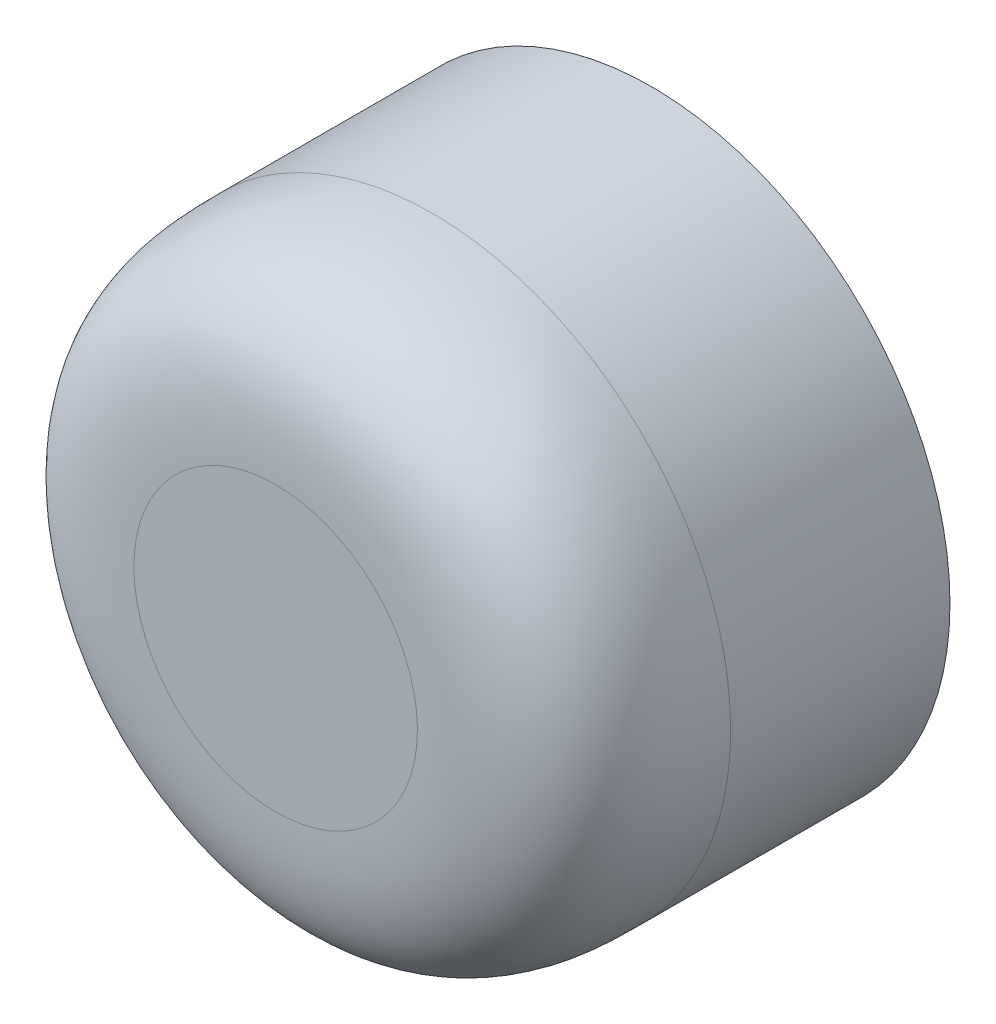
ISO-10303-21;
HEADER;
FILE_DESCRIPTION(('STEP AP214'),'2;1');
FILE_NAME('part.step','',(''),(''),'','','');
FILE_SCHEMA(('AUTOMOTIVE_DESIGN { 1 0 10303 214 1 1 1 1 }'));
ENDSEC;
DATA;
#1=APPLICATION_CONTEXT('core data for automotive mechanical design processes');
#2=APPLICATION_PROTOCOL_DEFINITION('international standard','automotive_design',2000,#1);
#3=PRODUCT_CONTEXT('',#1,'mechanical');
#4=PRODUCT('Part','Part','',(#3));
#5=PRODUCT_RELATED_PRODUCT_CATEGORY('part','',(#4));
#6=PRODUCT_DEFINITION_FORMATION('','',#4);
#7=PRODUCT_DEFINITION_CONTEXT('part definition',#1,'design');
#8=PRODUCT_DEFINITION('design','',#6,#7);
#9=PRODUCT_DEFINITION_SHAPE('','',#8);
#10=(LENGTH_UNIT() NAMED_UNIT(*) SI_UNIT(.MILLI.,.METRE.));
#11=(NAMED_UNIT(*) PLANE_ANGLE_UNIT() SI_UNIT($,.RADIAN.));
#12=(NAMED_UNIT(*) SI_UNIT($,.STERADIAN.) SOLID_ANGLE_UNIT());
#13=UNCERTAINTY_MEASURE_WITH_UNIT(LENGTH_MEASURE(1.E-05),#10,'distance_accuracy_value','');
#14=(GEOMETRIC_REPRESENTATION_CONTEXT(3) GLOBAL_UNCERTAINTY_ASSIGNED_CONTEXT((#13)) GLOBAL_UNIT_ASSIGNED_CONTEXT((#10,
#11,#12)) REPRESENTATION_CONTEXT('',''));
#15=CARTESIAN_POINT('',(0.,0.,0.));
#16=DIRECTION('',(0.,0.,1.));
#17=DIRECTION('',(1.,0.,0.));
#18=AXIS2_PLACEMENT_3D('',#15,#16,#17);
#19=CARTESIAN_POINT('',(0.,0.,12.));
#20=DIRECTION('',(0.,0.,-1.));
#21=DIRECTION('',(-1.,0.,0.));
#22=AXIS2_PLACEMENT_3D('',#19,#20,#21);
#23=CYLINDRICAL_SURFACE('',#22,9.525);
#24=CARTESIAN_POINT('',(9.525,0.,7.));
#25=CARTESIAN_POINT('',(9.525,1.24665180379261,7.));
#26=CARTESIAN_POINT('',(9.02905107681899,3.73995541137782,7.));
#27=CARTESIAN_POINT('',(6.9105365141536,6.9105365141536,7.));
#28=CARTESIAN_POINT('',(3.73995541137781,9.02905107681899,7.));
#29=CARTESIAN_POINT('',(0.,9.77297446159051,7.));
#30=CARTESIAN_POINT('',(-3.73995541137782,9.02905107681899,7.));
#31=CARTESIAN_POINT('',(-6.9105365141536,6.91053651415358,7.));
#32=CARTESIAN_POINT('',(-9.02905107681898,3.73995541137785,7.));
#33=CARTESIAN_POINT('',(-9.7729744615905,0.,7.));
#34=CARTESIAN_POINT('',(-9.029051076819,-3.73995541137779,7.));
#35=CARTESIAN_POINT('',(-6.91053651415358,-6.91053651415361,7.));
#36=CARTESIAN_POINT('',(-3.73995541137785,-9.02905107681897,7.));
#37=CARTESIAN_POINT('',(0.,-9.77297446159051,7.));
#38=CARTESIAN_POINT('',(3.73995541137779,-9.02905107681899,7.));
#39=CARTESIAN_POINT('',(6.91053651415358,-6.91053651415362,7.));
#40=CARTESIAN_POINT('',(9.02905107681898,-3.73995541137783,7.));
#41=CARTESIAN_POINT('',(9.525,-1.24665180379261,7.));
#42=CARTESIAN_POINT('',(9.525,0.,7.));
#43=B_SPLINE_CURVE_WITH_KNOTS('',3,(#24,#25,#26,#27,#28,#29,#30,#31,#32,#33,#34,#35,#36,#37,#38,
#39,#40,#41,#42),.UNSPECIFIED.,.T.,.F.,(4,1,1,1,1,1,1,1,1,1,1,1,1,1,1,1,4),(0.,
0.392699081698724,0.785398163397448,1.17809724509617,1.5707963267949,1.96349540849362,
2.35619449019234,2.74889357189107,3.14159265358979,3.53429173528852,3.92699081698724,
4.31968989868597,4.71238898038469,5.10508806208341,5.49778714378214,5.89048622548086,
6.28318530717959),.UNSPECIFIED.);
#44=CARTESIAN_POINT('',(9.525,0.,7.));
#45=VERTEX_POINT('',#44);
#46=EDGE_CURVE('E10',#45,#45,#43,.F.);
#47=ORIENTED_EDGE('',*,*,#46,.T.);
#48=EDGE_LOOP('',(#47));
#49=FACE_BOUND('',#48,.T.);
#50=CARTESIAN_POINT('',(0.,0.,0.));
#51=DIRECTION('',(0.,0.,1.));
#52=DIRECTION('',(1.,0.,0.));
#53=AXIS2_PLACEMENT_3D('',#50,#51,#52);
#54=CIRCLE('',#53,9.525);
#55=CARTESIAN_POINT('',(9.525,0.,0.));
#56=VERTEX_POINT('',#55);
#57=EDGE_CURVE('E51',#56,#56,#54,.T.);
#58=ORIENTED_EDGE('',*,*,#57,.T.);
#59=EDGE_LOOP('',(#58));
#60=FACE_BOUND('',#59,.T.);
#61=ADVANCED_FACE('F33',(#49,#60),#23,.T.);
#62=CARTESIAN_POINT('',(0.,0.,12.));
#63=DIRECTION('',(0.,0.,1.));
#64=DIRECTION('',(1.,0.,0.));
#65=AXIS2_PLACEMENT_3D('',#62,#63,#64);
#66=PLANE('',#65);
#67=CARTESIAN_POINT('',(4.525,0.,12.));
#68=CARTESIAN_POINT('',(4.52500005359573,-0.0740319228077651,12.));
#69=CARTESIAN_POINT('',(4.5231592298511,-0.148062308991933,12.));
#70=CARTESIAN_POINT('',(4.51583144496194,-0.295946996831009,12.));
#71=CARTESIAN_POINT('',(4.51034426931116,-0.369801287870123,12.));
#72=CARTESIAN_POINT('',(4.49575890582572,-0.517157077712651,12.));
#73=CARTESIAN_POINT('',(4.4866604701935,-0.590658551956111,12.));
#74=CARTESIAN_POINT('',(4.46488758724288,-0.737133065383583,12.));
#75=CARTESIAN_POINT('',(4.45221298569578,-0.810106081637632,12.));
#76=CARTESIAN_POINT('',(4.42332263004839,-0.955347719452519,12.));
#77=CARTESIAN_POINT('',(4.4071068759481,-1.02761634101336,12.));
#78=CARTESIAN_POINT('',(4.37116901219801,-1.17127329588665,12.));
#79=CARTESIAN_POINT('',(4.35144705381296,-1.24266166703286,12.));
#80=CARTESIAN_POINT('',(4.30853160908515,-1.38438212811499,12.));
#81=CARTESIAN_POINT('',(4.28533836106953,-1.45471429020219,12.));
#82=CARTESIAN_POINT('',(4.23551512311112,-1.59414657644436,12.));
#83=CARTESIAN_POINT('',(4.20888533542997,-1.66324677283593,12.));
#84=CARTESIAN_POINT('',(4.15222443379717,-1.80003829006815,12.));
#85=CARTESIAN_POINT('',(4.12219331984551,-1.8677296109088,12.));
#86=CARTESIAN_POINT('',(4.0588301540157,-2.00155347555232,12.));
#87=CARTESIAN_POINT('',(4.02549790803794,-2.06768592741361,12.));
#88=CARTESIAN_POINT('',(3.95563221145121,-2.19824322802937,12.));
#89=CARTESIAN_POINT('',(3.91909854130089,-2.26266795927973,12.));
#90=CARTESIAN_POINT('',(3.84292963966635,-2.38966067502199,12.));
#91=CARTESIAN_POINT('',(3.80329427446915,-2.45222857930618,12.));
#92=CARTESIAN_POINT('',(3.72102150070867,-2.57535848662685,12.));
#93=CARTESIAN_POINT('',(3.6783840921454,-2.63592048966332,12.));
#94=CARTESIAN_POINT('',(3.59020669800922,-2.75488938724318,12.));
#95=CARTESIAN_POINT('',(3.54466683770832,-2.8132963746271,12.));
#96=CARTESIAN_POINT('',(3.45078406442709,-2.9278059776471,12.));
#97=CARTESIAN_POINT('',(3.40244134402124,-2.98390875114606,12.));
#98=CARTESIAN_POINT('',(3.30305224828884,-3.09366085902961,12.));
#99=CARTESIAN_POINT('',(3.25200603218393,-3.14731033755432,12.));
#100=CARTESIAN_POINT('',(3.14731033755431,-3.25200603218395,12.));
#101=CARTESIAN_POINT('',(3.09366085902959,-3.30305224828886,12.));
#102=CARTESIAN_POINT('',(2.98390875114603,-3.40244134402125,12.));
#103=CARTESIAN_POINT('',(2.92780597764707,-3.4507840644271,12.));
#104=CARTESIAN_POINT('',(2.81329637462709,-3.54466683770834,12.));
#105=CARTESIAN_POINT('',(2.7548893872432,-3.59020669800924,12.));
#106=CARTESIAN_POINT('',(2.63592048966327,-3.67838409214541,12.));
#107=CARTESIAN_POINT('',(2.57535848662671,-3.72102150070868,12.));
#108=CARTESIAN_POINT('',(2.45222857930628,-3.80329427446917,12.));
#109=CARTESIAN_POINT('',(2.38966067502242,-3.84292963966639,12.));
#110=CARTESIAN_POINT('',(2.26266795927926,-3.91909854130088,12.));
#111=CARTESIAN_POINT('',(2.19824322802766,-3.95563221145112,12.));
#112=CARTESIAN_POINT('',(2.06768592741528,-4.02549790803805,12.));
#113=CARTESIAN_POINT('',(2.00155347555862,-4.05883015401609,12.));
#114=CARTESIAN_POINT('',(1.86772961090247,-4.12219331984514,12.));
#115=CARTESIAN_POINT('',(1.80003829004456,-4.15222443379575,12.));
#116=CARTESIAN_POINT('',(1.66324677285949,-4.2088853354314,12.));
#117=CARTESIAN_POINT('',(1.59414657653232,-4.23551512311644,12.));
#118=CARTESIAN_POINT('',(1.4547142901142,-4.28533836106422,12.));
#119=CARTESIAN_POINT('',(1.38438212778661,-4.30853160906532,12.));
#120=CARTESIAN_POINT('',(1.24266166736125,-4.3514470538328,12.));
#121=CARTESIAN_POINT('',(1.17127329711225,-4.37116901227205,12.));
#122=CARTESIAN_POINT('',(1.02761633978769,-4.40710687587406,12.));
#123=CARTESIAN_POINT('',(0.955347714878181,-4.42332262977205,12.));
#124=CARTESIAN_POINT('',(0.810106086211968,-4.45221298597213,12.));
#125=CARTESIAN_POINT('',(0.737133082455265,-4.46488758827421,12.));
#126=CARTESIAN_POINT('',(0.590658534885169,-4.48666046916222,12.));
#127=CARTESIAN_POINT('',(0.517157014004287,-4.49575890197699,12.));
#128=CARTESIAN_POINT('',(0.369801351574122,-4.51034427315963,12.));
#129=CARTESIAN_POINT('',(0.295947234569648,-4.51583145932414,12.));
#130=CARTESIAN_POINT('',(0.148062071267291,-4.52315921548975,12.));
#131=CARTESIAN_POINT('',(0.0740310356336492,-4.525,12.));
#132=CARTESIAN_POINT('',(-0.0740310356336353,-4.525,12.));
#133=CARTESIAN_POINT('',(-0.148062071267278,-4.52315921548974,12.));
#134=CARTESIAN_POINT('',(-0.295947234569636,-4.51583145932414,12.));
#135=CARTESIAN_POINT('',(-0.36980135157411,-4.51034427315963,12.));
#136=CARTESIAN_POINT('',(-0.517157014004277,-4.49575890197699,12.));
#137=CARTESIAN_POINT('',(-0.59065853488516,-4.48666046916222,12.));
#138=CARTESIAN_POINT('',(-0.737133082455259,-4.46488758827421,12.));
#139=CARTESIAN_POINT('',(-0.810106086211963,-4.45221298597212,12.));
#140=CARTESIAN_POINT('',(-0.955347714878179,-4.42332262977205,12.));
#141=CARTESIAN_POINT('',(-1.02761633978769,-4.40710687587406,12.));
#142=CARTESIAN_POINT('',(-1.17127329711225,-4.37116901227205,12.));
#143=CARTESIAN_POINT('',(-1.24266166736125,-4.35144705383279,12.));
#144=CARTESIAN_POINT('',(-1.38438212778662,-4.30853160906531,12.));
#145=CARTESIAN_POINT('',(-1.45471429011421,-4.28533836106422,12.));
#146=CARTESIAN_POINT('',(-1.59414657653233,-4.23551512311643,12.));
#147=CARTESIAN_POINT('',(-1.6632467728595,-4.20888533543139,12.));
#148=CARTESIAN_POINT('',(-1.80003829004457,-4.15222443379574,12.));
#149=CARTESIAN_POINT('',(-1.86772961090248,-4.12219331984513,12.));
#150=CARTESIAN_POINT('',(-2.00155347555863,-4.05883015401608,12.));
#151=CARTESIAN_POINT('',(-2.0676859274153,-4.02549790803805,12.));
#152=CARTESIAN_POINT('',(-2.19824322802767,-3.95563221145111,12.));
#153=CARTESIAN_POINT('',(-2.26266795927927,-3.91909854130087,12.));
#154=CARTESIAN_POINT('',(-2.38966067502243,-3.84292963966638,12.));
#155=CARTESIAN_POINT('',(-2.4522285793063,-3.80329427446916,12.));
#156=CARTESIAN_POINT('',(-2.57535848662672,-3.72102150070867,12.));
#157=CARTESIAN_POINT('',(-2.63592048966328,-3.6783840921454,12.));
#158=CARTESIAN_POINT('',(-2.75488938724321,-3.59020669800923,12.));
#159=CARTESIAN_POINT('',(-2.8132963746271,-3.54466683770833,12.));
#160=CARTESIAN_POINT('',(-2.92780597764708,-3.4507840644271,12.));
#161=CARTESIAN_POINT('',(-2.98390875114604,-3.40244134402125,12.));
#162=CARTESIAN_POINT('',(-3.0936608590296,-3.30305224828885,12.));
#163=CARTESIAN_POINT('',(-3.14731033755431,-3.25200603218394,12.));
#164=CARTESIAN_POINT('',(-3.25200603218394,-3.14731033755432,12.));
#165=CARTESIAN_POINT('',(-3.30305224828884,-3.0936608590296,12.));
#166=CARTESIAN_POINT('',(-3.40244134402124,-2.98390875114604,12.));
#167=CARTESIAN_POINT('',(-3.45078406442709,-2.92780597764708,12.));
#168=CARTESIAN_POINT('',(-3.54466683770833,-2.8132963746271,12.));
#169=CARTESIAN_POINT('',(-3.59020669800923,-2.75488938724321,12.));
#170=CARTESIAN_POINT('',(-3.6783840921454,-2.63592048966328,12.));
#171=CARTESIAN_POINT('',(-3.72102150070867,-2.57535848662672,12.));
#172=CARTESIAN_POINT('',(-3.80329427446916,-2.45222857930629,12.));
#173=CARTESIAN_POINT('',(-3.84292963966639,-2.38966067502243,12.));
#174=CARTESIAN_POINT('',(-3.91909854130087,-2.26266795927926,12.));
#175=CARTESIAN_POINT('',(-3.95563221145112,-2.19824322802767,12.));
#176=CARTESIAN_POINT('',(-4.02549790803805,-2.06768592741529,12.));
#177=CARTESIAN_POINT('',(-4.05883015401608,-2.00155347555862,12.));
#178=CARTESIAN_POINT('',(-4.12219331984514,-1.86772961090247,12.));
#179=CARTESIAN_POINT('',(-4.15222443379575,-1.80003829004456,12.));
#180=CARTESIAN_POINT('',(-4.2088853354314,-1.66324677285949,12.));
#181=CARTESIAN_POINT('',(-4.23551512311643,-1.59414657653232,12.));
#182=CARTESIAN_POINT('',(-4.28533836106422,-1.4547142901142,12.));
#183=CARTESIAN_POINT('',(-4.30853160906532,-1.38438212778661,12.));
#184=CARTESIAN_POINT('',(-4.3514470538328,-1.24266166736125,12.));
#185=CARTESIAN_POINT('',(-4.37116901227205,-1.17127329711225,12.));
#186=CARTESIAN_POINT('',(-4.40710687587406,-1.02761633978769,12.));
#187=CARTESIAN_POINT('',(-4.42332262977205,-0.955347714878177,12.));
#188=CARTESIAN_POINT('',(-4.45221298597213,-0.810106086211962,12.));
#189=CARTESIAN_POINT('',(-4.46488758827421,-0.737133082455259,12.));
#190=CARTESIAN_POINT('',(-4.48666046916222,-0.590658534885162,12.));
#191=CARTESIAN_POINT('',(-4.49575890197699,-0.517157014004281,12.));
#192=CARTESIAN_POINT('',(-4.51034427315963,-0.369801351574116,12.));
#193=CARTESIAN_POINT('',(-4.51583145932414,-0.295947234569642,12.));
#194=CARTESIAN_POINT('',(-4.52315921548974,-0.148062071267284,12.));
#195=CARTESIAN_POINT('',(-4.525,-0.0740310356336416,12.));
#196=CARTESIAN_POINT('',(-4.525,0.0740310356336429,12.));
#197=CARTESIAN_POINT('',(-4.52315921548974,0.148062071267285,12.));
#198=CARTESIAN_POINT('',(-4.51583145932414,0.295947234569644,12.));
#199=CARTESIAN_POINT('',(-4.51034427315963,0.369801351574119,12.));
#200=CARTESIAN_POINT('',(-4.49575890197699,0.517157014004285,12.));
#201=CARTESIAN_POINT('',(-4.48666046916221,0.590658534885166,12.));
#202=CARTESIAN_POINT('',(-4.46488758827421,0.737133082455264,12.));
#203=CARTESIAN_POINT('',(-4.45221298597212,0.810106086211968,12.));
#204=CARTESIAN_POINT('',(-4.42332262977205,0.955347714878184,12.));
#205=CARTESIAN_POINT('',(-4.40710687587406,1.0276163397877,12.));
#206=CARTESIAN_POINT('',(-4.37116901227205,1.17127329711226,12.));
#207=CARTESIAN_POINT('',(-4.35144705383279,1.24266166736126,12.));
#208=CARTESIAN_POINT('',(-4.30853160906531,1.38438212778662,12.));
#209=CARTESIAN_POINT('',(-4.28533836106421,1.45471429011421,12.));
#210=CARTESIAN_POINT('',(-4.23551512311643,1.59414657653234,12.));
#211=CARTESIAN_POINT('',(-4.20888533543139,1.6632467728595,12.));
#212=CARTESIAN_POINT('',(-4.15222443379575,1.80003829004457,12.));
#213=CARTESIAN_POINT('',(-4.12219331984513,1.86772961090248,12.));
#214=CARTESIAN_POINT('',(-4.05883015401608,2.00155347555863,12.));
#215=CARTESIAN_POINT('',(-4.02549790803805,2.0676859274153,12.));
#216=CARTESIAN_POINT('',(-3.95563221145111,2.19824322802767,12.));
#217=CARTESIAN_POINT('',(-3.91909854130087,2.26266795927927,12.));
#218=CARTESIAN_POINT('',(-3.84292963966638,2.38966067502243,12.));
#219=CARTESIAN_POINT('',(-3.80329427446916,2.4522285793063,12.));
#220=CARTESIAN_POINT('',(-3.72102150070867,2.57535848662672,12.));
#221=CARTESIAN_POINT('',(-3.6783840921454,2.63592048966329,12.));
#222=CARTESIAN_POINT('',(-3.59020669800923,2.75488938724321,12.));
#223=CARTESIAN_POINT('',(-3.54466683770833,2.8132963746271,12.));
#224=CARTESIAN_POINT('',(-3.4507840644271,2.92780597764708,12.));
#225=CARTESIAN_POINT('',(-3.40244134402125,2.98390875114604,12.));
#226=CARTESIAN_POINT('',(-3.30305224828885,3.0936608590296,12.));
#227=CARTESIAN_POINT('',(-3.25200603218394,3.14731033755431,12.));
#228=CARTESIAN_POINT('',(-3.14731033755432,3.25200603218394,12.));
#229=CARTESIAN_POINT('',(-3.0936608590296,3.30305224828884,12.));
#230=CARTESIAN_POINT('',(-2.98390875114605,3.40244134402124,12.));
#231=CARTESIAN_POINT('',(-2.92780597764708,3.45078406442709,12.));
#232=CARTESIAN_POINT('',(-2.8132963746271,3.54466683770833,12.));
#233=CARTESIAN_POINT('',(-2.75488938724321,3.59020669800923,12.));
#234=CARTESIAN_POINT('',(-2.63592048966329,3.6783840921454,12.));
#235=CARTESIAN_POINT('',(-2.57535848662672,3.72102150070867,12.));
#236=CARTESIAN_POINT('',(-2.4522285793063,3.80329427446916,12.));
#237=CARTESIAN_POINT('',(-2.38966067502243,3.84292963966638,12.));
#238=CARTESIAN_POINT('',(-2.26266795927927,3.91909854130087,12.));
#239=CARTESIAN_POINT('',(-2.19824322802767,3.95563221145111,12.));
#240=CARTESIAN_POINT('',(-2.06768592741529,4.02549790803805,12.));
#241=CARTESIAN_POINT('',(-2.00155347555863,4.05883015401608,12.));
#242=CARTESIAN_POINT('',(-1.86772961090248,4.12219331984513,12.));
#243=CARTESIAN_POINT('',(-1.80003829004457,4.15222443379575,12.));
#244=CARTESIAN_POINT('',(-1.6632467728595,4.2088853354314,12.));
#245=CARTESIAN_POINT('',(-1.59414657653233,4.23551512311643,12.));
#246=CARTESIAN_POINT('',(-1.45471429011421,4.28533836106422,12.));
#247=CARTESIAN_POINT('',(-1.38438212778662,4.30853160906531,12.));
#248=CARTESIAN_POINT('',(-1.24266166736125,4.3514470538328,12.));
#249=CARTESIAN_POINT('',(-1.17127329711225,4.37116901227205,12.));
#250=CARTESIAN_POINT('',(-1.02761633978769,4.40710687587406,12.));
#251=CARTESIAN_POINT('',(-0.95534771487818,4.42332262977205,12.));
#252=CARTESIAN_POINT('',(-0.810106086211965,4.45221298597213,12.));
#253=CARTESIAN_POINT('',(-0.737133082455261,4.46488758827421,12.));
#254=CARTESIAN_POINT('',(-0.590658534885164,4.48666046916222,12.));
#255=CARTESIAN_POINT('',(-0.517157014004282,4.49575890197699,12.));
#256=CARTESIAN_POINT('',(-0.369801351574118,4.51034427315963,12.));
#257=CARTESIAN_POINT('',(-0.295947234569643,4.51583145932414,12.));
#258=CARTESIAN_POINT('',(-0.148062071267285,4.52315921548974,12.));
#259=CARTESIAN_POINT('',(-0.0740310356336423,4.525,12.));
#260=CARTESIAN_POINT('',(0.0740310356336429,4.525,12.));
#261=CARTESIAN_POINT('',(0.148062071267285,4.52315921548974,12.));
#262=CARTESIAN_POINT('',(0.295947234569643,4.51583145932414,12.));
#263=CARTESIAN_POINT('',(0.369801351574118,4.51034427315963,12.));
#264=CARTESIAN_POINT('',(0.517157014004282,4.49575890197699,12.));
#265=CARTESIAN_POINT('',(0.590658534885163,4.48666046916222,12.));
#266=CARTESIAN_POINT('',(0.73713308245526,4.46488758827421,12.));
#267=CARTESIAN_POINT('',(0.810106086211964,4.45221298597212,12.));
#268=CARTESIAN_POINT('',(0.955347714878179,4.42332262977205,12.));
#269=CARTESIAN_POINT('',(1.02761633978769,4.40710687587406,12.));
#270=CARTESIAN_POINT('',(1.17127329711225,4.37116901227205,12.));
#271=CARTESIAN_POINT('',(1.24266166736125,4.3514470538328,12.));
#272=CARTESIAN_POINT('',(1.38438212778661,4.30853160906531,12.));
#273=CARTESIAN_POINT('',(1.4547142901142,4.28533836106422,12.));
#274=CARTESIAN_POINT('',(1.59414657653233,4.23551512311643,12.));
#275=CARTESIAN_POINT('',(1.66324677285949,4.2088853354314,12.));
#276=CARTESIAN_POINT('',(1.80003829004457,4.15222443379575,12.));
#277=CARTESIAN_POINT('',(1.86772961090247,4.12219331984513,12.));
#278=CARTESIAN_POINT('',(2.00155347555862,4.05883015401608,12.));
#279=CARTESIAN_POINT('',(2.06768592741529,4.02549790803805,12.));
#280=CARTESIAN_POINT('',(2.19824322802767,3.95563221145112,12.));
#281=CARTESIAN_POINT('',(2.26266795927927,3.91909854130087,12.));
#282=CARTESIAN_POINT('',(2.38966067502243,3.84292963966638,12.));
#283=CARTESIAN_POINT('',(2.4522285793063,3.80329427446916,12.));
#284=CARTESIAN_POINT('',(2.57535848662672,3.72102150070867,12.));
#285=CARTESIAN_POINT('',(2.63592048966328,3.6783840921454,12.));
#286=CARTESIAN_POINT('',(2.75488938724321,3.59020669800923,12.));
#287=CARTESIAN_POINT('',(2.8132963746271,3.54466683770833,12.));
#288=CARTESIAN_POINT('',(2.92780597764708,3.45078406442709,12.));
#289=CARTESIAN_POINT('',(2.98390875114604,3.40244134402124,12.));
#290=CARTESIAN_POINT('',(3.0936608590296,3.30305224828885,12.));
#291=CARTESIAN_POINT('',(3.14731033755432,3.25200603218394,12.));
#292=CARTESIAN_POINT('',(3.25200603218394,3.14731033755432,12.));
#293=CARTESIAN_POINT('',(3.30305224828885,3.0936608590296,12.));
#294=CARTESIAN_POINT('',(3.40244134402124,2.98390875114604,12.));
#295=CARTESIAN_POINT('',(3.4507840644271,2.92780597764709,12.));
#296=CARTESIAN_POINT('',(3.54466683770833,2.81329637462709,12.));
#297=CARTESIAN_POINT('',(3.59020669800923,2.75488938724318,12.));
#298=CARTESIAN_POINT('',(3.6783840921454,2.63592048966332,12.));
#299=CARTESIAN_POINT('',(3.72102150070868,2.57535848662685,12.));
#300=CARTESIAN_POINT('',(3.80329427446916,2.45222857930618,12.));
#301=CARTESIAN_POINT('',(3.84292963966636,2.38966067502198,12.));
#302=CARTESIAN_POINT('',(3.9190985413009,2.26266795927972,12.));
#303=CARTESIAN_POINT('',(3.95563221145122,2.19824322802936,12.));
#304=CARTESIAN_POINT('',(4.02549790803795,2.0676859274136,12.));
#305=CARTESIAN_POINT('',(4.0588301540157,2.00155347555231,12.));
#306=CARTESIAN_POINT('',(4.12219331984552,1.86772961090879,12.));
#307=CARTESIAN_POINT('',(4.15222443379717,1.80003829006814,12.));
#308=CARTESIAN_POINT('',(4.20888533542997,1.66324677283592,12.));
#309=CARTESIAN_POINT('',(4.23551512311112,1.59414657644435,12.));
#310=CARTESIAN_POINT('',(4.28533836106953,1.45471429020219,12.));
#311=CARTESIAN_POINT('',(4.30853160908515,1.38438212811498,12.));
#312=CARTESIAN_POINT('',(4.35144705381296,1.24266166703286,12.));
#313=CARTESIAN_POINT('',(4.37116901219801,1.17127329588664,12.));
#314=CARTESIAN_POINT('',(4.4071068759481,1.02761634101335,12.));
#315=CARTESIAN_POINT('',(4.42332263004839,0.955347719452516,12.));
#316=CARTESIAN_POINT('',(4.45221298569578,0.810106081637629,12.));
#317=CARTESIAN_POINT('',(4.46488758724288,0.73713306538358,12.));
#318=CARTESIAN_POINT('',(4.4866604701935,0.590658551956109,12.));
#319=CARTESIAN_POINT('',(4.49575890582572,0.51715707771265,12.));
#320=CARTESIAN_POINT('',(4.51034426931116,0.369801287870123,12.));
#321=CARTESIAN_POINT('',(4.51583144496194,0.295946996831009,12.));
#322=CARTESIAN_POINT('',(4.5231592298511,0.148062308991933,12.));
#323=CARTESIAN_POINT('',(4.52500005359573,0.0740319228077653,12.));
#324=CARTESIAN_POINT('',(4.525,0.,12.));
#325=B_SPLINE_CURVE_WITH_KNOTS('',3,(#67,#68,#69,#70,#71,#72,#73,#74,#75,#76,#77,#78,#79,#80,
#81,#82,#83,#84,#85,#86,#87,#88,#89,#90,#91,#92,#93,#94,#95,#96,#97,#98,#99,#100,#101,#102,#103,
#104,#105,#106,#107,#108,#109,#110,#111,#112,#113,#114,#115,#116,#117,#118,#119,#120,#121,#122,
#123,#124,#125,#126,#127,#128,#129,#130,#131,#132,#133,#134,#135,#136,#137,#138,#139,#140,#141,
#142,#143,#144,#145,#146,#147,#148,#149,#150,#151,#152,#153,#154,#155,#156,#157,#158,#159,#160,
#161,#162,#163,#164,#165,#166,#167,#168,#169,#170,#171,#172,#173,#174,#175,#176,#177,#178,#179,
#180,#181,#182,#183,#184,#185,#186,#187,#188,#189,#190,#191,#192,#193,#194,#195,#196,#197,#198,
#199,#200,#201,#202,#203,#204,#205,#206,#207,#208,#209,#210,#211,#212,#213,#214,#215,#216,#217,
#218,#219,#220,#221,#222,#223,#224,#225,#226,#227,#228,#229,#230,#231,#232,#233,#234,#235,#236,
#237,#238,#239,#240,#241,#242,#243,#244,#245,#246,#247,#248,#249,#250,#251,#252,#253,#254,#255,
#256,#257,#258,#259,#260,#261,#262,#263,#264,#265,#266,#267,#268,#269,#270,#271,#272,#273,#274,
#275,#276,#277,#278,#279,#280,#281,#282,#283,#284,#285,#286,#287,#288,#289,#290,#291,#292,#293,
#294,#295,#296,#297,#298,#299,#300,#301,#302,#303,#304,#305,#306,#307,#308,#309,#310,#311,#312,
#313,#314,#315,#316,#317,#318,#319,#320,#321,#322,#323,#324),.UNSPECIFIED.,.F.,.F.,(4,2,2,2,2,2,
2,2,2,2,2,2,2,2,2,2,2,2,2,2,2,2,2,2,2,2,2,2,2,2,2,2,2,2,2,2,2,2,2,2,2,2,2,2,2,2,2,2,2,2,2,2,2,2,
2,2,2,2,2,2,2,2,2,2,2,2,2,2,2,2,2,2,2,2,2,2,2,2,2,2,2,2,2,2,2,2,2,2,2,2,2,2,2,2,2,2,2,2,2,2,2,2,
2,2,2,2,2,2,2,2,2,2,2,2,2,2,2,2,2,2,2,2,2,2,2,2,2,2,4),(0.,0.222070710131196,0.444154485312362,
0.66625350208046,0.888362098739287,1.11047069539811,1.33256971216621,1.55465348734737,
1.77672419747858,1.99879490760977,2.22087868279094,2.44297769955903,2.66508629621786,
2.88719489287669,3.10929390964479,3.33137768482595,3.55344839495715,3.77551910508834,
3.99760288026951,4.21970189703761,4.44181049369643,4.66391909035526,4.88601810712335,
5.10810188230452,5.33017259243571,5.55224330256691,5.77432707774807,5.99642609451616,
6.21853469117499,6.44064328783381,6.66274230460191,6.88482607978307,7.10689678991426,
7.32896750004546,7.55105127522663,7.77315029199473,7.99525888865355,8.21736748531238,
8.43946650208048,8.66155027726165,8.88362098739285,9.10569169752404,9.32777547270521,
9.5498744894733,9.77198308613212,9.99409168279095,10.216190699559,10.4382744747402,
10.6603451848714,10.8824158950026,11.1044996701838,11.3265986869519,11.5487072836107,
11.7708158802695,11.9929148970376,12.2149986722188,12.43706938235,12.6591400924812,
12.8812238676623,13.1033228844304,13.3254314810893,13.5475400777481,13.7696390945162,
13.9917228696973,14.2137935798285,14.4358642899597,14.6579480651409,14.880047081909,
15.1021556785678,15.3242642752267,15.5463632919947,15.7684470671759,15.9905177773071,
16.2125884874383,16.4346722626195,16.6567712793876,16.8788798760464,17.1009884727052,
17.3230874894733,17.5451712646545,17.7672419747857,17.9893126849169,18.211396460098,
18.4334954768661,18.655604073525,18.8777126701838,19.0998116869519,19.321895462133,
19.5439661722642,19.7660368823954,19.9881206575766,20.2102196743447,20.4323282710035,
20.6544368676624,20.8765358844305,21.0986196596116,21.3206903697428,21.542761079874,
21.7648448550552,21.9869438718233,22.2090524684821,22.4311610651409,22.653260081909,
22.8753438570902,23.0974145672214,23.3194852773526,23.5415690525338,23.7636680693018,
23.9857766659607,24.2078852626195,24.4299842793876,24.6520680545688,24.8741387647,
25.0962094748312,25.3182932500123,25.5403922667804,25.7625008634393,25.9846094600981,
26.2067084768662,26.4287922520473,26.6508629621785,26.8729336723097,27.0950174474909,
27.317116464259,27.5392250609178,27.7613336575767,27.9834326743447,28.2055164495259,
28.4275871596571),.UNSPECIFIED.);
#326=CARTESIAN_POINT('',(4.525,0.,12.));
#327=VERTEX_POINT('',#326);
#328=EDGE_CURVE('E46',#327,#327,#325,.F.);
#329=ORIENTED_EDGE('',*,*,#328,.T.);
#330=EDGE_LOOP('',(#329));
#331=FACE_BOUND('',#330,.T.);
#332=ADVANCED_FACE('F64',(#331),#66,.T.);
#333=CARTESIAN_POINT('',(0.,0.,0.));
#334=DIRECTION('',(0.,0.,1.));
#335=DIRECTION('',(1.,0.,0.));
#336=AXIS2_PLACEMENT_3D('',#333,#334,#335);
#337=PLANE('',#336);
#338=ORIENTED_EDGE('',*,*,#57,.F.);
#339=EDGE_LOOP('',(#338));
#340=FACE_BOUND('',#339,.T.);
#341=ADVANCED_FACE('F73',(#340),#337,.F.);
#342=CARTESIAN_POINT('',(4.525,0.,12.));
#343=CARTESIAN_POINT('',(4.525,0.592241408100951,12.));
#344=CARTESIAN_POINT('',(4.28939171890876,1.77672422430285,12.));
#345=CARTESIAN_POINT('',(3.28295829150079,3.28295829150079,12.));
#346=CARTESIAN_POINT('',(1.77672422430285,4.28939171890876,12.));
#347=CARTESIAN_POINT('',(0.,4.64280414054562,12.));
#348=CARTESIAN_POINT('',(-1.77672422430285,4.28939171890876,12.));
#349=CARTESIAN_POINT('',(-3.28295829150079,3.28295829150078,12.));
#350=CARTESIAN_POINT('',(-4.28939171890875,1.77672422430286,12.));
#351=CARTESIAN_POINT('',(-4.64280414054562,0.,12.));
#352=CARTESIAN_POINT('',(-4.28939171890876,-1.77672422430284,12.));
#353=CARTESIAN_POINT('',(-3.28295829150078,-3.2829582915008,12.));
#354=CARTESIAN_POINT('',(-1.77672422430286,-4.28939171890875,12.));
#355=CARTESIAN_POINT('',(0.,-4.64280414054563,12.));
#356=CARTESIAN_POINT('',(1.77672422430284,-4.28939171890876,12.));
#357=CARTESIAN_POINT('',(3.28295829150078,-3.2829582915008,12.));
#358=CARTESIAN_POINT('',(4.28939171890876,-1.77672422430285,12.));
#359=CARTESIAN_POINT('',(4.525,-0.59224140810095,12.));
#360=CARTESIAN_POINT('',(4.525,0.,12.));
#361=CARTESIAN_POINT('',(5.36599025766973,0.,12.));
#362=CARTESIAN_POINT('',(5.36599025766973,0.702311961559846,12.));
#363=CARTESIAN_POINT('',(5.08659318784389,2.10693588467954,12.));
#364=CARTESIAN_POINT('',(3.89310988033797,3.89310988033797,12.));
#365=CARTESIAN_POINT('',(2.10693588467953,5.08659318784389,12.));
#366=CARTESIAN_POINT('',(0.,5.50568879258265,12.));
#367=CARTESIAN_POINT('',(-2.10693588467954,5.08659318784389,12.));
#368=CARTESIAN_POINT('',(-3.89310988033797,3.89310988033796,12.));
#369=CARTESIAN_POINT('',(-5.08659318784389,2.10693588467955,12.));
#370=CARTESIAN_POINT('',(-5.50568879258265,0.,12.));
#371=CARTESIAN_POINT('',(-5.0865931878439,-2.10693588467952,12.));
#372=CARTESIAN_POINT('',(-3.89310988033796,-3.89310988033798,12.));
#373=CARTESIAN_POINT('',(-2.10693588467955,-5.08659318784389,12.));
#374=CARTESIAN_POINT('',(0.,-5.50568879258266,12.));
#375=CARTESIAN_POINT('',(2.10693588467952,-5.08659318784389,12.));
#376=CARTESIAN_POINT('',(3.89310988033796,-3.89310988033798,12.));
#377=CARTESIAN_POINT('',(5.08659318784389,-2.10693588467954,12.));
#378=CARTESIAN_POINT('',(5.36599025766973,-0.702311961559846,12.));
#379=CARTESIAN_POINT('',(5.36599025766973,0.,12.));
#380=CARTESIAN_POINT('',(6.20698051533947,0.,12.));
#381=CARTESIAN_POINT('',(6.20698051533947,0.812382515018742,12.));
#382=CARTESIAN_POINT('',(5.88379465677903,2.43714754505622,12.));
#383=CARTESIAN_POINT('',(4.50326146917515,4.50326146917515,12.));
#384=CARTESIAN_POINT('',(2.43714754505622,5.88379465677903,12.));
#385=CARTESIAN_POINT('',(0.,6.36857344461968,12.));
#386=CARTESIAN_POINT('',(-2.43714754505622,5.88379465677903,12.));
#387=CARTESIAN_POINT('',(-4.50326146917515,4.50326146917514,12.));
#388=CARTESIAN_POINT('',(-5.88379465677902,2.43714754505624,12.));
#389=CARTESIAN_POINT('',(-6.36857344461968,0.,12.));
#390=CARTESIAN_POINT('',(-5.88379465677904,-2.43714754505621,12.));
#391=CARTESIAN_POINT('',(-4.50326146917514,-4.50326146917516,12.));
#392=CARTESIAN_POINT('',(-2.43714754505624,-5.88379465677902,12.));
#393=CARTESIAN_POINT('',(0.,-6.36857344461969,12.));
#394=CARTESIAN_POINT('',(2.4371475450562,-5.88379465677903,12.));
#395=CARTESIAN_POINT('',(4.50326146917514,-4.50326146917516,12.));
#396=CARTESIAN_POINT('',(5.88379465677903,-2.43714754505623,12.));
#397=CARTESIAN_POINT('',(6.20698051533947,-0.812382515018742,12.));
#398=CARTESIAN_POINT('',(6.20698051533947,0.,12.));
#399=CARTESIAN_POINT('',(8.06053390593274,0.,11.6415404008196));
#400=CARTESIAN_POINT('',(8.06053390593274,1.05497943657349,11.6415404008196));
#401=CARTESIAN_POINT('',(7.64083699140135,3.16493830972048,11.6415404008196));
#402=CARTESIAN_POINT('',(5.84804345202324,5.84804345202323,11.6415404008196));
#403=CARTESIAN_POINT('',(3.16493830972047,7.64083699140135,11.6415404008196));
#404=CARTESIAN_POINT('',(0.,8.27038236319843,11.6415404008196));
#405=CARTESIAN_POINT('',(-3.16493830972048,7.64083699140136,11.6415404008196));
#406=CARTESIAN_POINT('',(-5.84804345202324,5.84804345202322,11.6415404008196));
#407=CARTESIAN_POINT('',(-7.64083699140135,3.1649383097205,11.6415404008196));
#408=CARTESIAN_POINT('',(-8.27038236319842,0.,11.6415404008196));
#409=CARTESIAN_POINT('',(-7.64083699140137,-3.16493830972046,11.6415404008196));
#410=CARTESIAN_POINT('',(-5.84804345202322,-5.84804345202325,11.6415404008196));
#411=CARTESIAN_POINT('',(-3.1649383097205,-7.64083699140134,11.6415404008196));
#412=CARTESIAN_POINT('',(0.,-8.27038236319843,11.6415404008196));
#413=CARTESIAN_POINT('',(3.16493830972045,-7.64083699140135,11.6415404008196));
#414=CARTESIAN_POINT('',(5.84804345202322,-5.84804345202326,11.6415404008196));
#415=CARTESIAN_POINT('',(7.64083699140135,-3.16493830972048,11.6415404008196));
#416=CARTESIAN_POINT('',(8.06053390593274,-1.05497943657349,11.6415404008196));
#417=CARTESIAN_POINT('',(8.06053390593274,0.,11.6415404008196));
#418=CARTESIAN_POINT('',(9.16654040081958,0.,10.5355339059327));
#419=CARTESIAN_POINT('',(9.16654040081958,1.19973586616478,10.5355339059327));
#420=CARTESIAN_POINT('',(8.68925579808134,3.59920759849434,10.5355339059327));
#421=CARTESIAN_POINT('',(6.65046846701605,6.65046846701605,10.5355339059327));
#422=CARTESIAN_POINT('',(3.59920759849433,8.68925579808134,10.5355339059327));
#423=CARTESIAN_POINT('',(0.,9.4051827021887,10.5355339059327));
#424=CARTESIAN_POINT('',(-3.59920759849435,8.68925579808135,10.5355339059327));
#425=CARTESIAN_POINT('',(-6.65046846701606,6.65046846701603,10.5355339059327));
#426=CARTESIAN_POINT('',(-8.68925579808133,3.59920759849437,10.5355339059327));
#427=CARTESIAN_POINT('',(-9.4051827021887,0.,10.5355339059327));
#428=CARTESIAN_POINT('',(-8.68925579808136,-3.59920759849432,10.5355339059327));
#429=CARTESIAN_POINT('',(-6.65046846701603,-6.65046846701607,10.5355339059327));
#430=CARTESIAN_POINT('',(-3.59920759849437,-8.68925579808133,10.5355339059327));
#431=CARTESIAN_POINT('',(0.,-9.40518270218871,10.5355339059327));
#432=CARTESIAN_POINT('',(3.59920759849431,-8.68925579808134,10.5355339059327));
#433=CARTESIAN_POINT('',(6.65046846701603,-6.65046846701608,10.5355339059327));
#434=CARTESIAN_POINT('',(8.68925579808133,-3.59920759849435,10.5355339059327));
#435=CARTESIAN_POINT('',(9.16654040081958,-1.19973586616478,10.5355339059327));
#436=CARTESIAN_POINT('',(9.16654040081958,0.,10.5355339059327));
#437=CARTESIAN_POINT('',(9.525,0.,8.68198051533946));
#438=CARTESIAN_POINT('',(9.525,1.24665180379261,8.68198051533947));
#439=CARTESIAN_POINT('',(9.02905107681899,3.73995541137782,8.68198051533947));
#440=CARTESIAN_POINT('',(6.9105365141536,6.9105365141536,8.68198051533946));
#441=CARTESIAN_POINT('',(3.73995541137781,9.02905107681899,8.68198051533946));
#442=CARTESIAN_POINT('',(0.,9.77297446159051,8.68198051533946));
#443=CARTESIAN_POINT('',(-3.73995541137782,9.02905107681899,8.68198051533947));
#444=CARTESIAN_POINT('',(-6.9105365141536,6.91053651415358,8.68198051533946));
#445=CARTESIAN_POINT('',(-9.02905107681898,3.73995541137785,8.68198051533947));
#446=CARTESIAN_POINT('',(-9.7729744615905,0.,8.68198051533946));
#447=CARTESIAN_POINT('',(-9.029051076819,-3.73995541137779,8.68198051533947));
#448=CARTESIAN_POINT('',(-6.91053651415358,-6.91053651415361,8.68198051533946));
#449=CARTESIAN_POINT('',(-3.73995541137785,-9.02905107681897,8.68198051533946));
#450=CARTESIAN_POINT('',(0.,-9.77297446159051,8.68198051533947));
#451=CARTESIAN_POINT('',(3.73995541137779,-9.02905107681899,8.68198051533946));
#452=CARTESIAN_POINT('',(6.91053651415358,-6.91053651415362,8.68198051533947));
#453=CARTESIAN_POINT('',(9.02905107681898,-3.73995541137783,8.68198051533946));
#454=CARTESIAN_POINT('',(9.525,-1.24665180379261,8.68198051533946));
#455=CARTESIAN_POINT('',(9.525,0.,8.68198051533946));
#456=CARTESIAN_POINT('',(9.525,0.,7.84099025766973));
#457=CARTESIAN_POINT('',(9.525,1.24665180379261,7.84099025766973));
#458=CARTESIAN_POINT('',(9.02905107681899,3.73995541137782,7.84099025766974));
#459=CARTESIAN_POINT('',(6.9105365141536,6.9105365141536,7.84099025766973));
#460=CARTESIAN_POINT('',(3.73995541137781,9.02905107681899,7.84099025766973));
#461=CARTESIAN_POINT('',(0.,9.77297446159051,7.84099025766973));
#462=CARTESIAN_POINT('',(-3.73995541137782,9.02905107681899,7.84099025766973));
#463=CARTESIAN_POINT('',(-6.9105365141536,6.91053651415358,7.84099025766973));
#464=CARTESIAN_POINT('',(-9.02905107681898,3.73995541137785,7.84099025766974));
#465=CARTESIAN_POINT('',(-9.7729744615905,0.,7.84099025766973));
#466=CARTESIAN_POINT('',(-9.029051076819,-3.73995541137779,7.84099025766974));
#467=CARTESIAN_POINT('',(-6.91053651415358,-6.91053651415361,7.84099025766973));
#468=CARTESIAN_POINT('',(-3.73995541137785,-9.02905107681897,7.84099025766973));
#469=CARTESIAN_POINT('',(0.,-9.77297446159051,7.84099025766974));
#470=CARTESIAN_POINT('',(3.73995541137779,-9.02905107681899,7.84099025766973));
#471=CARTESIAN_POINT('',(6.91053651415358,-6.91053651415362,7.84099025766973));
#472=CARTESIAN_POINT('',(9.02905107681898,-3.73995541137783,7.84099025766974));
#473=CARTESIAN_POINT('',(9.525,-1.24665180379261,7.84099025766973));
#474=CARTESIAN_POINT('',(9.525,0.,7.84099025766973));
#475=CARTESIAN_POINT('',(9.525,0.,7.));
#476=CARTESIAN_POINT('',(9.525,1.24665180379261,7.));
#477=CARTESIAN_POINT('',(9.02905107681899,3.73995541137782,7.));
#478=CARTESIAN_POINT('',(6.9105365141536,6.9105365141536,7.));
#479=CARTESIAN_POINT('',(3.73995541137781,9.02905107681899,7.));
#480=CARTESIAN_POINT('',(0.,9.77297446159051,7.));
#481=CARTESIAN_POINT('',(-3.73995541137782,9.02905107681899,7.));
#482=CARTESIAN_POINT('',(-6.9105365141536,6.91053651415358,7.));
#483=CARTESIAN_POINT('',(-9.02905107681898,3.73995541137785,7.));
#484=CARTESIAN_POINT('',(-9.7729744615905,0.,7.));
#485=CARTESIAN_POINT('',(-9.029051076819,-3.73995541137779,7.));
#486=CARTESIAN_POINT('',(-6.91053651415358,-6.91053651415361,7.));
#487=CARTESIAN_POINT('',(-3.73995541137785,-9.02905107681897,7.));
#488=CARTESIAN_POINT('',(0.,-9.77297446159051,7.));
#489=CARTESIAN_POINT('',(3.73995541137779,-9.02905107681899,7.));
#490=CARTESIAN_POINT('',(6.91053651415358,-6.91053651415362,7.));
#491=CARTESIAN_POINT('',(9.02905107681898,-3.73995541137783,7.));
#492=CARTESIAN_POINT('',(9.525,-1.24665180379261,7.));
#493=CARTESIAN_POINT('',(9.525,0.,7.));
#494=B_SPLINE_SURFACE_WITH_KNOTS('',5,3,((#342,#343,#344,#345,#346,#347,#348,#349,#350,#351,
#352,#353,#354,#355,#356,#357,#358,#359,#360),(#361,#362,#363,#364,#365,#366,#367,#368,#369,
#370,#371,#372,#373,#374,#375,#376,#377,#378,#379),(#380,#381,#382,#383,#384,#385,#386,#387,
#388,#389,#390,#391,#392,#393,#394,#395,#396,#397,#398),(#399,#400,#401,#402,#403,#404,#405,
#406,#407,#408,#409,#410,#411,#412,#413,#414,#415,#416,#417),(#418,#419,#420,#421,#422,#423,
#424,#425,#426,#427,#428,#429,#430,#431,#432,#433,#434,#435,#436),(#437,#438,#439,#440,#441,
#442,#443,#444,#445,#446,#447,#448,#449,#450,#451,#452,#453,#454,#455),(#456,#457,#458,#459,
#460,#461,#462,#463,#464,#465,#466,#467,#468,#469,#470,#471,#472,#473,#474),(#475,#476,#477,
#478,#479,#480,#481,#482,#483,#484,#485,#486,#487,#488,#489,#490,#491,#492,#493)),.UNSPECIFIED.,
.F.,.T.,.F.,(6,2,6),(4,1,1,1,1,1,1,1,1,1,1,1,1,1,1,1,4),(0.,0.5,1.),(0.,0.392699081698724,
0.785398163397448,1.17809724509617,1.5707963267949,1.96349540849362,2.35619449019234,
2.74889357189107,3.14159265358979,3.53429173528852,3.92699081698724,4.31968989868597,
4.71238898038469,5.10508806208341,5.49778714378214,5.89048622548086,6.28318530717959),.UNSPECIFIED.);
#495=ORIENTED_EDGE('',*,*,#46,.F.);
#496=EDGE_LOOP('',(#495));
#497=FACE_BOUND('',#496,.T.);
#498=ORIENTED_EDGE('',*,*,#328,.F.);
#499=EDGE_LOOP('',(#498));
#500=FACE_BOUND('',#499,.T.);
#501=ADVANCED_FACE('F36',(#497,#500),#494,.T.);
#502=CLOSED_SHELL('',(#61,#332,#341,#501));
#503=MANIFOLD_SOLID_BREP('B2',#502);
#504=ADVANCED_BREP_SHAPE_REPRESENTATION('',(#18,#503),#14);
#505=SHAPE_DEFINITION_REPRESENTATION(#9,#504);
ENDSEC;
END-ISO-10303-21;
